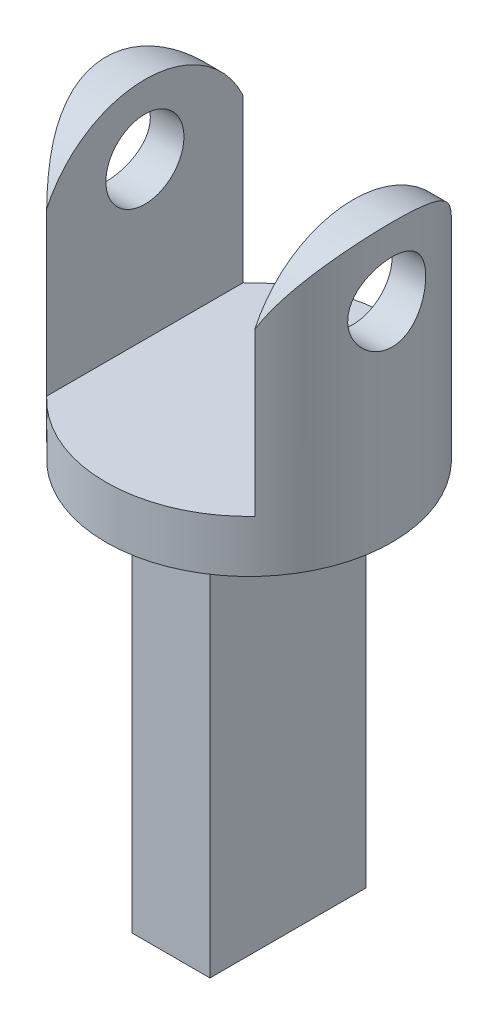
ISO-10303-21;
HEADER;
FILE_DESCRIPTION(('STEP AP214'),'2;1');
FILE_NAME('part.step','',(''),(''),'','','');
FILE_SCHEMA(('AUTOMOTIVE_DESIGN { 1 0 10303 214 1 1 1 1 }'));
ENDSEC;
DATA;
#1=APPLICATION_CONTEXT('core data for automotive mechanical design processes');
#2=APPLICATION_PROTOCOL_DEFINITION('international standard','automotive_design',2000,#1);
#3=PRODUCT_CONTEXT('',#1,'mechanical');
#4=PRODUCT('Part','Part','',(#3));
#5=PRODUCT_RELATED_PRODUCT_CATEGORY('part','',(#4));
#6=PRODUCT_DEFINITION_FORMATION('','',#4);
#7=PRODUCT_DEFINITION_CONTEXT('part definition',#1,'design');
#8=PRODUCT_DEFINITION('design','',#6,#7);
#9=PRODUCT_DEFINITION_SHAPE('','',#8);
#10=(LENGTH_UNIT() NAMED_UNIT(*) SI_UNIT(.MILLI.,.METRE.));
#11=(NAMED_UNIT(*) PLANE_ANGLE_UNIT() SI_UNIT($,.RADIAN.));
#12=(NAMED_UNIT(*) SI_UNIT($,.STERADIAN.) SOLID_ANGLE_UNIT());
#13=UNCERTAINTY_MEASURE_WITH_UNIT(LENGTH_MEASURE(1.E-05),#10,'distance_accuracy_value','');
#14=(GEOMETRIC_REPRESENTATION_CONTEXT(3) GLOBAL_UNCERTAINTY_ASSIGNED_CONTEXT((#13)) GLOBAL_UNIT_ASSIGNED_CONTEXT((#10,
#11,#12)) REPRESENTATION_CONTEXT('',''));
#15=CARTESIAN_POINT('',(0.,0.,0.));
#16=DIRECTION('',(0.,0.,1.));
#17=DIRECTION('',(1.,0.,0.));
#18=AXIS2_PLACEMENT_3D('',#15,#16,#17);
#19=CARTESIAN_POINT('',(4.,35.,-25.));
#20=DIRECTION('',(1.,0.,0.));
#21=DIRECTION('',(0.,1.,0.));
#22=AXIS2_PLACEMENT_3D('',#19,#20,#21);
#23=PLANE('',#22);
#24=CARTESIAN_POINT('',(4.,23.,0.));
#25=DIRECTION('',(1.,0.,0.));
#26=DIRECTION('',(0.,1.,0.));
#27=AXIS2_PLACEMENT_3D('',#24,#25,#26);
#28=CIRCLE('',#27,1.5);
#29=CARTESIAN_POINT('',(4.,24.5,0.));
#30=VERTEX_POINT('',#29);
#31=EDGE_CURVE('E170',#30,#30,#28,.T.);
#32=ORIENTED_EDGE('',*,*,#31,.T.);
#33=EDGE_LOOP('',(#32));
#34=FACE_BOUND('',#33,.T.);
#35=DIRECTION('',(0.,-1.,0.));
#36=VECTOR('',#35,1.);
#37=CARTESIAN_POINT('',(4.,26.,3.77491721763537));
#38=LINE('',#37,#36);
#39=CARTESIAN_POINT('',(4.,23.2320508075689,3.77491721763537));
#40=VERTEX_POINT('',#39);
#41=CARTESIAN_POINT('',(4.,17.,3.77491721763537));
#42=VERTEX_POINT('',#41);
#43=EDGE_CURVE('E199',#40,#42,#38,.T.);
#44=ORIENTED_EDGE('',*,*,#43,.F.);
#45=CARTESIAN_POINT('',(4.,21.5,0.));
#46=DIRECTION('',(1.,0.,0.));
#47=DIRECTION('',(0.,1.,0.));
#48=AXIS2_PLACEMENT_3D('',#45,#46,#47);
#49=CIRCLE('',#48,4.15331193145904);
#50=CARTESIAN_POINT('',(4.,23.2320508075689,-3.77491721763537));
#51=VERTEX_POINT('',#50);
#52=EDGE_CURVE('E151',#40,#51,#49,.F.);
#53=ORIENTED_EDGE('',*,*,#52,.T.);
#54=DIRECTION('',(0.,-1.,0.));
#55=VECTOR('',#54,1.);
#56=CARTESIAN_POINT('',(4.,26.,-3.77491721763537));
#57=LINE('',#56,#55);
#58=CARTESIAN_POINT('',(4.,17.,-3.77491721763537));
#59=VERTEX_POINT('',#58);
#60=EDGE_CURVE('E196',#59,#51,#57,.F.);
#61=ORIENTED_EDGE('',*,*,#60,.F.);
#62=DIRECTION('',(0.,0.,1.));
#63=VECTOR('',#62,1.);
#64=CARTESIAN_POINT('',(4.,17.,-25.));
#65=LINE('',#64,#63);
#66=EDGE_CURVE('E186',#59,#42,#65,.T.);
#67=ORIENTED_EDGE('',*,*,#66,.T.);
#68=EDGE_LOOP('',(#44,#53,#61,#67));
#69=FACE_BOUND('',#68,.T.);
#70=ADVANCED_FACE('F35',(#34,#69),#23,.F.);
#71=CARTESIAN_POINT('',(-4.,35.,-25.));
#72=DIRECTION('',(-1.,0.,0.));
#73=DIRECTION('',(0.,-1.,0.));
#74=AXIS2_PLACEMENT_3D('',#71,#72,#73);
#75=PLANE('',#74);
#76=CARTESIAN_POINT('',(-4.,23.,0.));
#77=DIRECTION('',(-1.,0.,0.));
#78=DIRECTION('',(0.,-1.,0.));
#79=AXIS2_PLACEMENT_3D('',#76,#77,#78);
#80=CIRCLE('',#79,1.5);
#81=CARTESIAN_POINT('',(-4.,21.5,0.));
#82=VERTEX_POINT('',#81);
#83=EDGE_CURVE('E169',#82,#82,#80,.T.);
#84=ORIENTED_EDGE('',*,*,#83,.T.);
#85=EDGE_LOOP('',(#84));
#86=FACE_BOUND('',#85,.T.);
#87=DIRECTION('',(0.,-1.,0.));
#88=VECTOR('',#87,1.);
#89=CARTESIAN_POINT('',(-4.,26.,-3.77491721763537));
#90=LINE('',#89,#88);
#91=CARTESIAN_POINT('',(-4.,23.2320508075689,-3.77491721763537));
#92=VERTEX_POINT('',#91);
#93=CARTESIAN_POINT('',(-4.,17.,-3.77491721763537));
#94=VERTEX_POINT('',#93);
#95=EDGE_CURVE('E194',#92,#94,#90,.T.);
#96=ORIENTED_EDGE('',*,*,#95,.F.);
#97=CARTESIAN_POINT('',(-4.,21.5,0.));
#98=DIRECTION('',(-1.,0.,0.));
#99=DIRECTION('',(0.,-1.,0.));
#100=AXIS2_PLACEMENT_3D('',#97,#98,#99);
#101=CIRCLE('',#100,4.15331193145904);
#102=CARTESIAN_POINT('',(-4.,23.2320508075689,3.77491721763537));
#103=VERTEX_POINT('',#102);
#104=EDGE_CURVE('E11',#92,#103,#101,.F.);
#105=ORIENTED_EDGE('',*,*,#104,.T.);
#106=DIRECTION('',(0.,-1.,0.));
#107=VECTOR('',#106,1.);
#108=CARTESIAN_POINT('',(-4.,26.,3.77491721763537));
#109=LINE('',#108,#107);
#110=CARTESIAN_POINT('',(-4.,17.,3.77491721763537));
#111=VERTEX_POINT('',#110);
#112=EDGE_CURVE('E189',#111,#103,#109,.F.);
#113=ORIENTED_EDGE('',*,*,#112,.F.);
#114=DIRECTION('',(0.,0.,1.));
#115=VECTOR('',#114,1.);
#116=CARTESIAN_POINT('',(-4.,17.,-25.));
#117=LINE('',#116,#115);
#118=EDGE_CURVE('E185',#94,#111,#117,.T.);
#119=ORIENTED_EDGE('',*,*,#118,.F.);
#120=EDGE_LOOP('',(#96,#105,#113,#119));
#121=FACE_BOUND('',#120,.T.);
#122=ADVANCED_FACE('F207',(#86,#121),#75,.F.);
#123=CARTESIAN_POINT('',(0.,26.,0.));
#124=DIRECTION('',(0.,-1.,0.));
#125=DIRECTION('',(0.,0.,-1.));
#126=AXIS2_PLACEMENT_3D('',#123,#124,#125);
#127=CYLINDRICAL_SURFACE('',#126,5.5);
#128=CARTESIAN_POINT('',(0.,15.,0.));
#129=DIRECTION('',(0.,1.,0.));
#130=DIRECTION('',(0.,0.,1.));
#131=AXIS2_PLACEMENT_3D('',#128,#129,#130);
#132=CIRCLE('',#131,5.5);
#133=CARTESIAN_POINT('',(0.,15.,5.5));
#134=VERTEX_POINT('',#133);
#135=EDGE_CURVE('E40',#134,#134,#132,.T.);
#136=ORIENTED_EDGE('',*,*,#135,.T.);
#137=EDGE_LOOP('',(#136));
#138=FACE_BOUND('',#137,.T.);
#139=CARTESIAN_POINT('',(-5.29150262212918,23.,-1.5));
#140=CARTESIAN_POINT('',(-5.29150397933242,23.0825564510277,-1.4999981569703));
#141=CARTESIAN_POINT('',(-5.29345578048323,23.1651321099555,-1.49316121586719));
#142=CARTESIAN_POINT('',(-5.3010274190552,23.3278935253,-1.46604910592423));
#143=CARTESIAN_POINT('',(-5.30664898703923,23.4080781354985,-1.44576759691971));
#144=CARTESIAN_POINT('',(-5.32087717395131,23.5636791879618,-1.39248674622751));
#145=CARTESIAN_POINT('',(-5.32947946238205,23.6391023609042,-1.35950584697685));
#146=CARTESIAN_POINT('',(-5.34869425130277,23.7833581342367,-1.2818207402325));
#147=CARTESIAN_POINT('',(-5.35930693404948,23.8521901362373,-1.23711546969878));
#148=CARTESIAN_POINT('',(-5.38165786345274,23.9831102067913,-1.13599985857016));
#149=CARTESIAN_POINT('',(-5.39341679089298,24.045000328378,-1.07933774218464));
#150=CARTESIAN_POINT('',(-5.41655710292429,24.1585276577255,-0.956458027204654));
#151=CARTESIAN_POINT('',(-5.4279384467319,24.210163760916,-0.890239400501257));
#152=CARTESIAN_POINT('',(-5.44927272086847,24.3025486268105,-0.748747592415014));
#153=CARTESIAN_POINT('',(-5.45919841481043,24.3430997218264,-0.6733408831181));
#154=CARTESIAN_POINT('',(-5.4762652255866,24.4108728681829,-0.516463712056492));
#155=CARTESIAN_POINT('',(-5.48340683437022,24.4380972745742,-0.434994324603003));
#156=CARTESIAN_POINT('',(-5.49395456075485,24.4778010982805,-0.270371451848024));
#157=CARTESIAN_POINT('',(-5.4974458959785,24.4906174442147,-0.187304783419292));
#158=CARTESIAN_POINT('',(-5.50059802264474,24.5022023022979,-0.0201318714747489));
#159=CARTESIAN_POINT('',(-5.50025948354,24.5009732695445,0.0639741877907296));
#160=CARTESIAN_POINT('',(-5.49585206403333,24.4847376013516,0.228490060702586));
#161=CARTESIAN_POINT('',(-5.49188178563756,24.4700951266807,0.308938859429587));
#162=CARTESIAN_POINT('',(-5.48077394096948,24.4280376676544,0.466191004896713));
#163=CARTESIAN_POINT('',(-5.47363619004791,24.4006219386716,0.542994138822176));
#164=CARTESIAN_POINT('',(-5.45685088879515,24.333522864157,0.691693236894896));
#165=CARTESIAN_POINT('',(-5.44717834180867,24.2937165513123,0.763530775491583));
#166=CARTESIAN_POINT('',(-5.4263628785745,24.2030611057326,0.899629268661));
#167=CARTESIAN_POINT('',(-5.41521966459727,24.1522097356286,0.963888684077535));
#168=CARTESIAN_POINT('',(-5.39224620796906,24.0389820048791,1.08518074875882));
#169=CARTESIAN_POINT('',(-5.38040539296798,23.9762883280592,1.14191553261874));
#170=CARTESIAN_POINT('',(-5.35769198772825,23.8421547848866,1.24414076282169));
#171=CARTESIAN_POINT('',(-5.34681946230361,23.7707143338136,1.28963045681796));
#172=CARTESIAN_POINT('',(-5.32722971617593,23.6204456059996,1.36831504906637));
#173=CARTESIAN_POINT('',(-5.31852743967169,23.5415709942258,1.40142544272702));
#174=CARTESIAN_POINT('',(-5.30444735453973,23.3790773977709,1.45381649809065));
#175=CARTESIAN_POINT('',(-5.29906867769277,23.2954596583672,1.47310077178258));
#176=CARTESIAN_POINT('',(-5.29243075183376,23.12864781849,1.49677126460125));
#177=CARTESIAN_POINT('',(-5.29104827888985,23.0455218132359,1.50160329063472));
#178=CARTESIAN_POINT('',(-5.29222151202243,22.8796488564579,1.49746332611022));
#179=CARTESIAN_POINT('',(-5.29477677694071,22.7969018635137,1.48849288189024));
#180=CARTESIAN_POINT('',(-5.30341820279288,22.6358775626886,1.45739637961775));
#181=CARTESIAN_POINT('',(-5.3094315020934,22.5575435793702,1.43554156609381));
#182=CARTESIAN_POINT('',(-5.32423951436502,22.4056539900694,1.37960331838531));
#183=CARTESIAN_POINT('',(-5.33303460273288,22.3320990306223,1.34551823366713));
#184=CARTESIAN_POINT('',(-5.3526656797527,22.189999291833,1.26519240779034));
#185=CARTESIAN_POINT('',(-5.36354371589181,22.121607425495,1.21869167395158));
#186=CARTESIAN_POINT('',(-5.3860176273416,21.9934339346148,1.11517441622706));
#187=CARTESIAN_POINT('',(-5.39761364372337,21.9336540098999,1.05815582137422));
#188=CARTESIAN_POINT('',(-5.42064365021152,21.8225336360494,0.933153363001187));
#189=CARTESIAN_POINT('',(-5.43206199790196,21.7715049965658,0.8648888475196));
#190=CARTESIAN_POINT('',(-5.45308956662174,21.681629364909,0.720505557506886));
#191=CARTESIAN_POINT('',(-5.46269888388575,21.6427817246722,0.644387201108797));
#192=CARTESIAN_POINT('',(-5.47896373225224,21.5787329337421,0.48699233815191));
#193=CARTESIAN_POINT('',(-5.48564141597945,21.5534291096995,0.405760013245424));
#194=CARTESIAN_POINT('',(-5.49538823820121,21.5168930474549,0.239985864722818));
#195=CARTESIAN_POINT('',(-5.4984582160406,21.5056575361731,0.155444815623817));
#196=CARTESIAN_POINT('',(-5.50060207356917,21.4977898799094,-0.0116397196820234));
#197=CARTESIAN_POINT('',(-5.49980084994582,21.5007013286933,-0.0941604093051925));
#198=CARTESIAN_POINT('',(-5.4945768528746,21.51997977731,-0.257491304637166));
#199=CARTESIAN_POINT('',(-5.49015422670854,21.5363462299303,-0.338301579771118));
#200=CARTESIAN_POINT('',(-5.47821112917835,21.5818073703395,-0.49534203369685));
#201=CARTESIAN_POINT('',(-5.47071413494114,21.6108056982402,-0.571602011794993));
#202=CARTESIAN_POINT('',(-5.45340440920124,21.6806216215351,-0.718217369622537));
#203=CARTESIAN_POINT('',(-5.44359134174256,21.7214409318066,-0.788571890732096));
#204=CARTESIAN_POINT('',(-5.42235787347661,21.8150547282817,-0.923488675195432));
#205=CARTESIAN_POINT('',(-5.41090053751388,21.8681490724366,-0.987837043212875));
#206=CARTESIAN_POINT('',(-5.38781343748961,21.9842421385502,-1.10686496193089));
#207=CARTESIAN_POINT('',(-5.37618362817694,22.0472435029512,-1.16154192474211));
#208=CARTESIAN_POINT('',(-5.35375507792812,22.1831275268309,-1.2609396606189));
#209=CARTESIAN_POINT('',(-5.34298201162846,22.2562062026808,-1.30539879787935));
#210=CARTESIAN_POINT('',(-5.32385655741428,22.4090859451496,-1.3813380630303));
#211=CARTESIAN_POINT('',(-5.31550265682104,22.4888827705103,-1.41282630671052));
#212=CARTESIAN_POINT('',(-5.30326481572331,22.6402680192525,-1.45802611152119));
#213=CARTESIAN_POINT('',(-5.29889066810921,22.7112284687515,-1.47372831222932));
#214=CARTESIAN_POINT('',(-5.29300915582115,22.8547877979027,-1.494715407894));
#215=CARTESIAN_POINT('',(-5.29150142838456,22.9273864690513,-1.5000016210592));
#216=CARTESIAN_POINT('',(-5.29150262212918,23.,-1.5));
#217=B_SPLINE_CURVE_WITH_KNOTS('',3,(#139,#140,#141,#142,#143,#144,#145,#146,#147,#148,#149,
#150,#151,#152,#153,#154,#155,#156,#157,#158,#159,#160,#161,#162,#163,#164,#165,#166,#167,#168,
#169,#170,#171,#172,#173,#174,#175,#176,#177,#178,#179,#180,#181,#182,#183,#184,#185,#186,#187,
#188,#189,#190,#191,#192,#193,#194,#195,#196,#197,#198,#199,#200,#201,#202,#203,#204,#205,#206,
#207,#208,#209,#210,#211,#212,#213,#214,#215,#216),.UNSPECIFIED.,.T.,.F.,(4,2,2,2,2,2,2,2,2,2,2,
2,2,2,2,2,2,2,2,2,2,2,2,2,2,2,2,2,2,2,2,2,2,2,2,2,2,2,4),(0.,0.247402201391972,
0.494921155336744,0.742082002291412,0.989265266888855,1.24229327000826,1.49534851471804,
1.75265882819586,2.00992365416647,2.26103843021061,2.51210931268385,2.75655962385664,
3.0010241872433,3.24799669713118,3.49501928234234,3.74996416866223,4.00492610732058,
4.26159801830626,4.51820285087414,4.76680611540842,5.01538153009582,5.25890187447338,
5.50245509545499,5.75157425489229,6.00074251835821,6.25748556676549,6.51421495339718,
6.76896951768223,7.02366480072505,7.27019876040455,7.51672269408902,7.7613981255949,
8.00610907011738,8.25758505394756,8.50912822664455,8.76653181226182,9.02377409687475,
9.24140725781328,9.45901287413894),.UNSPECIFIED.);
#218=CARTESIAN_POINT('',(-5.29150262212918,23.,-1.5));
#219=VERTEX_POINT('',#218);
#220=EDGE_CURVE('E179',#219,#219,#217,.T.);
#221=ORIENTED_EDGE('',*,*,#220,.T.);
#222=EDGE_LOOP('',(#221));
#223=FACE_BOUND('',#222,.T.);
#224=CARTESIAN_POINT('',(5.29150262212918,23.,-1.5));
#225=CARTESIAN_POINT('',(5.29150397933242,22.9174435489722,-1.4999981569703));
#226=CARTESIAN_POINT('',(5.29345578048323,22.8348678900445,-1.49316121586719));
#227=CARTESIAN_POINT('',(5.3010274190552,22.6721064747,-1.46604910592423));
#228=CARTESIAN_POINT('',(5.30664898703923,22.5919218645014,-1.44576759691971));
#229=CARTESIAN_POINT('',(5.32087717395131,22.4363208120381,-1.39248674622751));
#230=CARTESIAN_POINT('',(5.32947946238205,22.3608976390958,-1.35950584697685));
#231=CARTESIAN_POINT('',(5.34869425130277,22.2166418657633,-1.2818207402325));
#232=CARTESIAN_POINT('',(5.35930693404948,22.1478098637627,-1.23711546969878));
#233=CARTESIAN_POINT('',(5.38165786345274,22.0168897932086,-1.13599985857016));
#234=CARTESIAN_POINT('',(5.39341679089298,21.9549996716219,-1.07933774218464));
#235=CARTESIAN_POINT('',(5.41655710292429,21.8414723422745,-0.956458027204653));
#236=CARTESIAN_POINT('',(5.4279384467319,21.789836239084,-0.890239400501256));
#237=CARTESIAN_POINT('',(5.44927272086847,21.6974513731895,-0.748747592415014));
#238=CARTESIAN_POINT('',(5.45919841481043,21.6569002781735,-0.673340883118099));
#239=CARTESIAN_POINT('',(5.4762652255866,21.5891271318171,-0.516463712056491));
#240=CARTESIAN_POINT('',(5.48340683437022,21.5619027254258,-0.434994324603003));
#241=CARTESIAN_POINT('',(5.49395456075485,21.5221989017194,-0.270371451848024));
#242=CARTESIAN_POINT('',(5.4974458959785,21.5093825557852,-0.187304783419292));
#243=CARTESIAN_POINT('',(5.50059802264474,21.497797697702,-0.0201318714747491));
#244=CARTESIAN_POINT('',(5.50025948354,21.4990267304555,0.0639741877907296));
#245=CARTESIAN_POINT('',(5.49585206403333,21.5152623986484,0.228490060702586));
#246=CARTESIAN_POINT('',(5.49188178563756,21.5299048733192,0.308938859429587));
#247=CARTESIAN_POINT('',(5.48077394096948,21.5719623323456,0.466191004896713));
#248=CARTESIAN_POINT('',(5.47363619004791,21.5993780613283,0.542994138822176));
#249=CARTESIAN_POINT('',(5.45685088879515,21.666477135843,0.691693236894896));
#250=CARTESIAN_POINT('',(5.44717834180867,21.7062834486877,0.763530775491583));
#251=CARTESIAN_POINT('',(5.4263628785745,21.7969388942674,0.899629268661));
#252=CARTESIAN_POINT('',(5.41521966459727,21.8477902643713,0.963888684077535));
#253=CARTESIAN_POINT('',(5.39224620796906,21.9610179951208,1.08518074875882));
#254=CARTESIAN_POINT('',(5.38040539296798,22.0237116719408,1.14191553261874));
#255=CARTESIAN_POINT('',(5.35769198772825,22.1578452151133,1.24414076282169));
#256=CARTESIAN_POINT('',(5.34681946230361,22.2292856661864,1.28963045681796));
#257=CARTESIAN_POINT('',(5.32722971617593,22.3795543940003,1.36831504906637));
#258=CARTESIAN_POINT('',(5.31852743967169,22.4584290057742,1.40142544272702));
#259=CARTESIAN_POINT('',(5.30444735453973,22.6209226022291,1.45381649809065));
#260=CARTESIAN_POINT('',(5.29906867769277,22.7045403416328,1.47310077178258));
#261=CARTESIAN_POINT('',(5.29243075183376,22.87135218151,1.49677126460125));
#262=CARTESIAN_POINT('',(5.29104827888985,22.9544781867641,1.50160329063472));
#263=CARTESIAN_POINT('',(5.29222151202243,23.120351143542,1.49746332611022));
#264=CARTESIAN_POINT('',(5.29477677694071,23.2030981364863,1.48849288189024));
#265=CARTESIAN_POINT('',(5.30341820279288,23.3641224373113,1.45739637961775));
#266=CARTESIAN_POINT('',(5.3094315020934,23.4424564206298,1.43554156609381));
#267=CARTESIAN_POINT('',(5.32423951436502,23.5943460099306,1.37960331838531));
#268=CARTESIAN_POINT('',(5.33303460273288,23.6679009693777,1.34551823366713));
#269=CARTESIAN_POINT('',(5.3526656797527,23.810000708167,1.26519240779034));
#270=CARTESIAN_POINT('',(5.36354371589181,23.878392574505,1.21869167395158));
#271=CARTESIAN_POINT('',(5.3860176273416,24.0065660653851,1.11517441622706));
#272=CARTESIAN_POINT('',(5.39761364372337,24.0663459901001,1.05815582137422));
#273=CARTESIAN_POINT('',(5.42064365021152,24.1774663639506,0.933153363001187));
#274=CARTESIAN_POINT('',(5.43206199790196,24.2284950034342,0.864888847519599));
#275=CARTESIAN_POINT('',(5.45308956662174,24.318370635091,0.720505557506885));
#276=CARTESIAN_POINT('',(5.46269888388575,24.3572182753278,0.644387201108796));
#277=CARTESIAN_POINT('',(5.47896373225224,24.4212670662579,0.48699233815191));
#278=CARTESIAN_POINT('',(5.48564141597945,24.4465708903005,0.405760013245424));
#279=CARTESIAN_POINT('',(5.49538823820121,24.4831069525451,0.239985864722818));
#280=CARTESIAN_POINT('',(5.4984582160406,24.4943424638269,0.155444815623817));
#281=CARTESIAN_POINT('',(5.50060207356917,24.5022101200906,-0.0116397196820234));
#282=CARTESIAN_POINT('',(5.49980084994582,24.4992986713067,-0.0941604093051925));
#283=CARTESIAN_POINT('',(5.4945768528746,24.48002022269,-0.257491304637166));
#284=CARTESIAN_POINT('',(5.49015422670854,24.4636537700697,-0.338301579771118));
#285=CARTESIAN_POINT('',(5.47821112917835,24.4181926296605,-0.49534203369685));
#286=CARTESIAN_POINT('',(5.47071413494114,24.3891943017597,-0.571602011794993));
#287=CARTESIAN_POINT('',(5.45340440920124,24.3193783784649,-0.718217369622537));
#288=CARTESIAN_POINT('',(5.44359134174256,24.2785590681934,-0.788571890732096));
#289=CARTESIAN_POINT('',(5.42235787347661,24.1849452717183,-0.923488675195432));
#290=CARTESIAN_POINT('',(5.41090053751388,24.1318509275633,-0.987837043212875));
#291=CARTESIAN_POINT('',(5.38781343748961,24.0157578614498,-1.10686496193089));
#292=CARTESIAN_POINT('',(5.37618362817694,23.9527564970487,-1.16154192474211));
#293=CARTESIAN_POINT('',(5.35375507792812,23.8168724731691,-1.2609396606189));
#294=CARTESIAN_POINT('',(5.34298201162846,23.7437937973192,-1.30539879787935));
#295=CARTESIAN_POINT('',(5.32385655741428,23.5909140548504,-1.3813380630303));
#296=CARTESIAN_POINT('',(5.31550265682104,23.5111172294897,-1.41282630671052));
#297=CARTESIAN_POINT('',(5.30326481572331,23.3597319807474,-1.45802611152119));
#298=CARTESIAN_POINT('',(5.29889066810921,23.2887715312485,-1.47372831222932));
#299=CARTESIAN_POINT('',(5.29300915582115,23.1452122020973,-1.494715407894));
#300=CARTESIAN_POINT('',(5.29150142838456,23.0726135309487,-1.5000016210592));
#301=CARTESIAN_POINT('',(5.29150262212918,23.,-1.5));
#302=B_SPLINE_CURVE_WITH_KNOTS('',3,(#224,#225,#226,#227,#228,#229,#230,#231,#232,#233,#234,
#235,#236,#237,#238,#239,#240,#241,#242,#243,#244,#245,#246,#247,#248,#249,#250,#251,#252,#253,
#254,#255,#256,#257,#258,#259,#260,#261,#262,#263,#264,#265,#266,#267,#268,#269,#270,#271,#272,
#273,#274,#275,#276,#277,#278,#279,#280,#281,#282,#283,#284,#285,#286,#287,#288,#289,#290,#291,
#292,#293,#294,#295,#296,#297,#298,#299,#300,#301),.UNSPECIFIED.,.T.,.F.,(4,2,2,2,2,2,2,2,2,2,2,
2,2,2,2,2,2,2,2,2,2,2,2,2,2,2,2,2,2,2,2,2,2,2,2,2,2,2,4),(0.,0.247402201391972,
0.494921155336744,0.742082002291415,0.989265266888855,1.24229327000826,1.49534851471804,
1.75265882819586,2.00992365416647,2.26103843021061,2.51210931268385,2.75655962385664,
3.0010241872433,3.24799669713118,3.49501928234234,3.74996416866223,4.00492610732058,
4.26159801830626,4.51820285087414,4.76680611540842,5.01538153009582,5.25890187447338,
5.50245509545499,5.75157425489229,6.00074251835821,6.25748556676549,6.51421495339718,
6.76896951768224,7.02366480072506,7.27019876040455,7.51672269408903,7.7613981255949,
8.00610907011738,8.25758505394756,8.50912822664455,8.76653181226183,9.02377409687476,
9.24140725781328,9.45901287413894),.UNSPECIFIED.);
#303=CARTESIAN_POINT('',(5.29150262212918,23.,-1.5));
#304=VERTEX_POINT('',#303);
#305=EDGE_CURVE('E173',#304,#304,#302,.T.);
#306=ORIENTED_EDGE('',*,*,#305,.T.);
#307=EDGE_LOOP('',(#306));
#308=FACE_BOUND('',#307,.T.);
#309=ORIENTED_EDGE('',*,*,#112,.T.);
#310=CARTESIAN_POINT('',(-3.60555127546399,21.5,4.15331193145904));
#311=CARTESIAN_POINT('',(-3.60547040250049,21.5976537652712,4.15334445103078));
#312=CARTESIAN_POINT('',(-3.60951656871601,21.6952526292036,4.14986954341714));
#313=CARTESIAN_POINT('',(-3.6252271787589,21.8891426539515,4.13617188406569));
#314=CARTESIAN_POINT('',(-3.63687432100341,21.9854362788915,4.12596445654146));
#315=CARTESIAN_POINT('',(-3.66694769951464,22.1746569621928,4.09925193730759));
#316=CARTESIAN_POINT('',(-3.68527830376266,22.2676121272456,4.08283556980207));
#317=CARTESIAN_POINT('',(-3.72778055764887,22.4509458957926,4.04406779635878));
#318=CARTESIAN_POINT('',(-3.75195577934866,22.54132288567,4.02171276004906));
#319=CARTESIAN_POINT('',(-3.81072273658934,22.7378064480999,3.96614990671222));
#320=CARTESIAN_POINT('',(-3.84643602736842,22.8432107771946,3.9316475794461));
#321=CARTESIAN_POINT('',(-3.9231300880453,23.0492203124615,3.85512597544404));
#322=CARTESIAN_POINT('',(-3.964111901597,23.1498245623462,3.81310520871511));
#323=CARTESIAN_POINT('',(-4.09299844356465,23.4453281854628,3.67601125613255));
#324=CARTESIAN_POINT('',(-4.18650794315925,23.6328944510109,3.57020438033287));
#325=CARTESIAN_POINT('',(-4.38006375488353,23.9916226206615,3.33007554588051));
#326=CARTESIAN_POINT('',(-4.48020635517096,24.1623549541508,3.19519909229987));
#327=CARTESIAN_POINT('',(-4.67694467230511,24.4815280381837,2.89960074407404));
#328=CARTESIAN_POINT('',(-4.77354658693113,24.6300092991662,2.73892694918007));
#329=CARTESIAN_POINT('',(-4.95257244117467,24.8966599393664,2.39942686972138));
#330=CARTESIAN_POINT('',(-5.03541618112195,25.0158250947115,2.22161940523791));
#331=CARTESIAN_POINT('',(-5.14786880233851,25.1744965925157,1.93901504320507));
#332=CARTESIAN_POINT('',(-5.18340147065904,25.2240641228168,1.84210348348945));
#333=CARTESIAN_POINT('',(-5.24978738322213,25.3159245811212,1.64337644867618));
#334=CARTESIAN_POINT('',(-5.28064290210647,25.3582210466179,1.5415633892782));
#335=CARTESIAN_POINT('',(-5.33723823615638,25.4353275615042,1.33256278162993));
#336=CARTESIAN_POINT('',(-5.36292579890519,25.470061410006,1.22533284316755));
#337=CARTESIAN_POINT('',(-5.4081290822959,25.5309149837235,1.00723893743802));
#338=CARTESIAN_POINT('',(-5.42764817913843,25.5570394214843,0.896376994885952));
#339=CARTESIAN_POINT('',(-5.45996620152354,25.6001749867533,0.672014890769008));
#340=CARTESIAN_POINT('',(-5.47277036003147,25.6171932109635,0.558516855769085));
#341=CARTESIAN_POINT('',(-5.49129147568882,25.641780813524,0.329935768269791));
#342=CARTESIAN_POINT('',(-5.4970097018813,25.649351883798,0.214853003318929));
#343=CARTESIAN_POINT('',(-5.50086818314378,25.6544616191678,0.00191325379482998));
#344=CARTESIAN_POINT('',(-5.50003042718692,25.6533532681761,-0.0958963109978608));
#345=CARTESIAN_POINT('',(-5.49316190230219,25.6442534707143,-0.291043486589168));
#346=CARTESIAN_POINT('',(-5.48712955395367,25.636259930796,-0.38838094479046));
#347=CARTESIAN_POINT('',(-5.47000506018238,25.6135157601249,-0.58177422543297));
#348=CARTESIAN_POINT('',(-5.45891487560159,25.5987677479632,-0.677830529717118));
#349=CARTESIAN_POINT('',(-5.43192050014674,25.5627452967543,-0.868036486986254));
#350=CARTESIAN_POINT('',(-5.41601443317236,25.5414683142036,-0.962185381633183));
#351=CARTESIAN_POINT('',(-5.36264175550506,25.4697541638921,-1.23516831895388));
#352=CARTESIAN_POINT('',(-5.31894494002206,25.410683514933,-1.41061482164376));
#353=CARTESIAN_POINT('',(-5.21763868152048,25.2717376146884,-1.74856317630322));
#354=CARTESIAN_POINT('',(-5.1600268513403,25.1918587935152,-1.91106280082991));
#355=CARTESIAN_POINT('',(-5.02595888686376,25.0021928159957,-2.24178892176472));
#356=CARTESIAN_POINT('',(-4.94801917612083,24.889849672731,-2.40794041317521));
#357=CARTESIAN_POINT('',(-4.78355620122666,24.6449463776872,-2.7200651203762));
#358=CARTESIAN_POINT('',(-4.69702292236105,24.5123625389856,-2.86601430756722));
#359=CARTESIAN_POINT('',(-4.55584894742765,24.2857078429398,-3.08280741429558));
#360=CARTESIAN_POINT('',(-4.50223781597343,24.1973388840586,-3.16040697016601));
#361=CARTESIAN_POINT('',(-4.39504549079252,24.0143451275046,-3.30785011847919));
#362=CARTESIAN_POINT('',(-4.34146429308014,23.9197217046599,-3.37769540644449));
#363=CARTESIAN_POINT('',(-4.23565932684829,23.7243120587831,-3.50946296315179));
#364=CARTESIAN_POINT('',(-4.18343615230125,23.6235232016367,-3.57138180997259));
#365=CARTESIAN_POINT('',(-4.08198176910243,23.4159239660317,-3.68691458686422));
#366=CARTESIAN_POINT('',(-4.03274938588635,23.3091159836314,-3.74053179019498));
#367=CARTESIAN_POINT('',(-3.91948216930946,23.0434574612212,-3.85965243764111));
#368=CARTESIAN_POINT('',(-3.85787041822836,22.8815269645307,-3.92074558683356));
#369=CARTESIAN_POINT('',(-3.75113787165504,22.5468488919203,-4.02299360084131));
#370=CARTESIAN_POINT('',(-3.70594534100126,22.3741523285229,-4.06423545870904));
#371=CARTESIAN_POINT('',(-3.65081081572278,22.0838279875265,-4.11368628795512));
#372=CARTESIAN_POINT('',(-3.63404142074593,21.9686134788316,-4.12843502540582));
#373=CARTESIAN_POINT('',(-3.61705550099533,21.7940723544053,-4.14330338521387));
#374=CARTESIAN_POINT('',(-3.6127543860935,21.7354258693232,-4.14705060823876));
#375=CARTESIAN_POINT('',(-3.60699694725637,21.6178577496237,-4.15205721680613));
#376=CARTESIAN_POINT('',(-3.60554209912899,21.5589359881359,-4.15331531172323));
#377=CARTESIAN_POINT('',(-3.60555127546399,21.5,-4.15331193145904));
#378=B_SPLINE_CURVE_WITH_KNOTS('',3,(#310,#311,#312,#313,#314,#315,#316,#317,#318,#319,#320,
#321,#322,#323,#324,#325,#326,#327,#328,#329,#330,#331,#332,#333,#334,#335,#336,#337,#338,#339,
#340,#341,#342,#343,#344,#345,#346,#347,#348,#349,#350,#351,#352,#353,#354,#355,#356,#357,#358,
#359,#360,#361,#362,#363,#364,#365,#366,#367,#368,#369,#370,#371,#372,#373,#374,#375,#376,#377),
.UNSPECIFIED.,.F.,.F.,(4,2,2,2,2,2,2,2,2,2,2,2,2,2,2,2,2,2,2,2,2,2,2,2,2,2,2,2,2,2,2,2,2,4),(0.,
0.292728216601007,0.584792429144946,0.872831813958145,1.1610476871561,1.51004508903029,
1.85911173144474,2.56055866198317,3.2768041674504,3.99172940200932,4.67724064531699,
5.0203972876737,5.36338650322484,5.70968631736051,6.05579626082551,6.40163607777832,
6.74741394817879,7.04050022963745,7.33367565573009,7.62673751890397,7.91991369600548,
8.48804405790041,9.05627195353878,9.69949918423067,10.3434850129496,10.7308932279985,
11.1182165661161,11.5057065555705,11.8930433701425,12.4424107538034,12.9893482520635,
13.3405267001499,13.517185075489,13.6939350250995),.UNSPECIFIED.);
#379=EDGE_CURVE('E143',#103,#92,#378,.T.);
#380=ORIENTED_EDGE('',*,*,#379,.T.);
#381=ORIENTED_EDGE('',*,*,#95,.T.);
#382=CARTESIAN_POINT('',(0.,17.,0.));
#383=DIRECTION('',(0.,-1.,0.));
#384=DIRECTION('',(0.,0.,-1.));
#385=AXIS2_PLACEMENT_3D('',#382,#383,#384);
#386=CIRCLE('',#385,5.5);
#387=EDGE_CURVE('E45',#94,#59,#386,.T.);
#388=ORIENTED_EDGE('',*,*,#387,.T.);
#389=ORIENTED_EDGE('',*,*,#60,.T.);
#390=CARTESIAN_POINT('',(3.60555127546399,21.5,-4.15331193145904));
#391=CARTESIAN_POINT('',(3.60547040250049,21.5976537652712,-4.15334445103078));
#392=CARTESIAN_POINT('',(3.60951656871601,21.6952526292036,-4.14986954341714));
#393=CARTESIAN_POINT('',(3.6252271787589,21.8891426539515,-4.13617188406569));
#394=CARTESIAN_POINT('',(3.63687432100341,21.9854362788915,-4.12596445654146));
#395=CARTESIAN_POINT('',(3.66694769951464,22.1746569621928,-4.09925193730759));
#396=CARTESIAN_POINT('',(3.68527830376266,22.2676121272456,-4.08283556980207));
#397=CARTESIAN_POINT('',(3.72778055764887,22.4509458957926,-4.04406779635878));
#398=CARTESIAN_POINT('',(3.75195577934866,22.54132288567,-4.02171276004906));
#399=CARTESIAN_POINT('',(3.81072273658934,22.7378064480999,-3.96614990671222));
#400=CARTESIAN_POINT('',(3.84643602736842,22.8432107771946,-3.9316475794461));
#401=CARTESIAN_POINT('',(3.9231300880453,23.0492203124615,-3.85512597544404));
#402=CARTESIAN_POINT('',(3.964111901597,23.1498245623462,-3.81310520871511));
#403=CARTESIAN_POINT('',(4.09299844356465,23.4453281854628,-3.67601125613255));
#404=CARTESIAN_POINT('',(4.18650794315925,23.6328944510109,-3.57020438033287));
#405=CARTESIAN_POINT('',(4.38006375488353,23.9916226206615,-3.33007554588051));
#406=CARTESIAN_POINT('',(4.48020635517096,24.1623549541508,-3.19519909229987));
#407=CARTESIAN_POINT('',(4.67694467230511,24.4815280381837,-2.89960074407404));
#408=CARTESIAN_POINT('',(4.77354658693113,24.6300092991662,-2.73892694918007));
#409=CARTESIAN_POINT('',(4.95257244117467,24.8966599393664,-2.39942686972138));
#410=CARTESIAN_POINT('',(5.03541618112195,25.0158250947115,-2.22161940523791));
#411=CARTESIAN_POINT('',(5.14786880233851,25.1744965925157,-1.93901504320507));
#412=CARTESIAN_POINT('',(5.18340147065904,25.2240641228168,-1.84210348348945));
#413=CARTESIAN_POINT('',(5.24978738322213,25.3159245811212,-1.64337644867618));
#414=CARTESIAN_POINT('',(5.28064290210647,25.3582210466179,-1.5415633892782));
#415=CARTESIAN_POINT('',(5.33723823615638,25.4353275615042,-1.33256278162993));
#416=CARTESIAN_POINT('',(5.36292579890519,25.470061410006,-1.22533284316755));
#417=CARTESIAN_POINT('',(5.4081290822959,25.5309149837235,-1.00723893743802));
#418=CARTESIAN_POINT('',(5.42764817913843,25.5570394214843,-0.896376994885952));
#419=CARTESIAN_POINT('',(5.45996620152354,25.6001749867533,-0.672014890769008));
#420=CARTESIAN_POINT('',(5.47277036003147,25.6171932109635,-0.558516855769085));
#421=CARTESIAN_POINT('',(5.49129147568882,25.641780813524,-0.329935768269791));
#422=CARTESIAN_POINT('',(5.4970097018813,25.649351883798,-0.214853003318929));
#423=CARTESIAN_POINT('',(5.50086818314378,25.6544616191678,-0.00191325379482998));
#424=CARTESIAN_POINT('',(5.50003042718692,25.6533532681761,0.0958963109978608));
#425=CARTESIAN_POINT('',(5.49316190230219,25.6442534707143,0.291043486589168));
#426=CARTESIAN_POINT('',(5.48712955395367,25.636259930796,0.38838094479046));
#427=CARTESIAN_POINT('',(5.47000506018238,25.6135157601249,0.58177422543297));
#428=CARTESIAN_POINT('',(5.45891487560159,25.5987677479632,0.677830529717118));
#429=CARTESIAN_POINT('',(5.43192050014674,25.5627452967543,0.868036486986254));
#430=CARTESIAN_POINT('',(5.41601443317236,25.5414683142036,0.962185381633183));
#431=CARTESIAN_POINT('',(5.36264175550506,25.4697541638921,1.23516831895388));
#432=CARTESIAN_POINT('',(5.31894494002206,25.410683514933,1.41061482164376));
#433=CARTESIAN_POINT('',(5.21763868152048,25.2717376146884,1.74856317630322));
#434=CARTESIAN_POINT('',(5.1600268513403,25.1918587935152,1.91106280082991));
#435=CARTESIAN_POINT('',(5.02595888686376,25.0021928159957,2.24178892176472));
#436=CARTESIAN_POINT('',(4.94801917612083,24.889849672731,2.40794041317521));
#437=CARTESIAN_POINT('',(4.78355620122666,24.6449463776872,2.7200651203762));
#438=CARTESIAN_POINT('',(4.69702292236105,24.5123625389856,2.86601430756722));
#439=CARTESIAN_POINT('',(4.55584894742765,24.2857078429398,3.08280741429558));
#440=CARTESIAN_POINT('',(4.50223781597343,24.1973388840586,3.16040697016601));
#441=CARTESIAN_POINT('',(4.39504549079252,24.0143451275046,3.30785011847919));
#442=CARTESIAN_POINT('',(4.34146429308014,23.9197217046599,3.37769540644449));
#443=CARTESIAN_POINT('',(4.23565932684829,23.7243120587831,3.50946296315179));
#444=CARTESIAN_POINT('',(4.18343615230125,23.6235232016367,3.57138180997259));
#445=CARTESIAN_POINT('',(4.08198176910243,23.4159239660317,3.68691458686422));
#446=CARTESIAN_POINT('',(4.03274938588635,23.3091159836314,3.74053179019498));
#447=CARTESIAN_POINT('',(3.91948216930946,23.0434574612212,3.85965243764111));
#448=CARTESIAN_POINT('',(3.85787041822836,22.8815269645307,3.92074558683356));
#449=CARTESIAN_POINT('',(3.75113787165504,22.5468488919203,4.02299360084131));
#450=CARTESIAN_POINT('',(3.70594534100126,22.3741523285229,4.06423545870904));
#451=CARTESIAN_POINT('',(3.65081081572278,22.0838279875265,4.11368628795512));
#452=CARTESIAN_POINT('',(3.63404142074593,21.9686134788316,4.12843502540582));
#453=CARTESIAN_POINT('',(3.61705550099533,21.7940723544053,4.14330338521387));
#454=CARTESIAN_POINT('',(3.6127543860935,21.7354258693232,4.14705060823876));
#455=CARTESIAN_POINT('',(3.60699694725637,21.6178577496237,4.15205721680613));
#456=CARTESIAN_POINT('',(3.60554209912899,21.5589359881359,4.15331531172323));
#457=CARTESIAN_POINT('',(3.60555127546399,21.5,4.15331193145904));
#458=B_SPLINE_CURVE_WITH_KNOTS('',3,(#390,#391,#392,#393,#394,#395,#396,#397,#398,#399,#400,
#401,#402,#403,#404,#405,#406,#407,#408,#409,#410,#411,#412,#413,#414,#415,#416,#417,#418,#419,
#420,#421,#422,#423,#424,#425,#426,#427,#428,#429,#430,#431,#432,#433,#434,#435,#436,#437,#438,
#439,#440,#441,#442,#443,#444,#445,#446,#447,#448,#449,#450,#451,#452,#453,#454,#455,#456,#457),
.UNSPECIFIED.,.F.,.F.,(4,2,2,2,2,2,2,2,2,2,2,2,2,2,2,2,2,2,2,2,2,2,2,2,2,2,2,2,2,2,2,2,2,4),(0.,
0.292728216601007,0.584792429144946,0.872831813958145,1.1610476871561,1.51004508903029,
1.85911173144474,2.56055866198317,3.2768041674504,3.99172940200932,4.67724064531699,
5.0203972876737,5.36338650322484,5.70968631736051,6.05579626082551,6.40163607777832,
6.74741394817879,7.04050022963745,7.33367565573009,7.62673751890397,7.91991369600548,
8.48804405790041,9.05627195353878,9.69949918423067,10.3434850129496,10.7308932279985,
11.1182165661161,11.5057065555705,11.8930433701425,12.4424107538034,12.9893482520635,
13.3405267001499,13.517185075489,13.6939350250995),.UNSPECIFIED.);
#459=EDGE_CURVE('E59',#51,#40,#458,.T.);
#460=ORIENTED_EDGE('',*,*,#459,.T.);
#461=ORIENTED_EDGE('',*,*,#43,.T.);
#462=EDGE_CURVE('E201',#42,#111,#386,.T.);
#463=ORIENTED_EDGE('',*,*,#462,.T.);
#464=EDGE_LOOP('',(#309,#380,#381,#388,#389,#460,#461,#463));
#465=FACE_BOUND('',#464,.T.);
#466=ADVANCED_FACE('F37',(#138,#223,#308,#465),#127,.T.);
#467=CARTESIAN_POINT('',(-4.,17.,-25.));
#468=DIRECTION('',(0.,-1.,0.));
#469=DIRECTION('',(0.,0.,-1.));
#470=AXIS2_PLACEMENT_3D('',#467,#468,#469);
#471=PLANE('',#470);
#472=ORIENTED_EDGE('',*,*,#66,.F.);
#473=ORIENTED_EDGE('',*,*,#387,.F.);
#474=ORIENTED_EDGE('',*,*,#118,.T.);
#475=ORIENTED_EDGE('',*,*,#462,.F.);
#476=EDGE_LOOP('',(#472,#473,#474,#475));
#477=FACE_BOUND('',#476,.T.);
#478=ADVANCED_FACE('F213',(#477),#471,.F.);
#479=CARTESIAN_POINT('',(-29.,23.,0.));
#480=DIRECTION('',(1.,0.,0.));
#481=DIRECTION('',(0.,0.,-1.));
#482=AXIS2_PLACEMENT_3D('',#479,#480,#481);
#483=CYLINDRICAL_SURFACE('',#482,1.5);
#484=ORIENTED_EDGE('',*,*,#83,.F.);
#485=EDGE_LOOP('',(#484));
#486=FACE_BOUND('',#485,.T.);
#487=ORIENTED_EDGE('',*,*,#220,.F.);
#488=EDGE_LOOP('',(#487));
#489=FACE_BOUND('',#488,.T.);
#490=ADVANCED_FACE('F160',(#486,#489),#483,.F.);
#491=ORIENTED_EDGE('',*,*,#31,.F.);
#492=EDGE_LOOP('',(#491));
#493=FACE_BOUND('',#492,.T.);
#494=ORIENTED_EDGE('',*,*,#305,.F.);
#495=EDGE_LOOP('',(#494));
#496=FACE_BOUND('',#495,.T.);
#497=ADVANCED_FACE('F212',(#493,#496),#483,.F.);
#498=CARTESIAN_POINT('',(-11.,21.5,0.));
#499=DIRECTION('',(1.,0.,0.));
#500=DIRECTION('',(0.,0.,-1.));
#501=AXIS2_PLACEMENT_3D('',#498,#499,#500);
#502=CYLINDRICAL_SURFACE('',#501,4.15331193145904);
#503=ORIENTED_EDGE('',*,*,#104,.F.);
#504=ORIENTED_EDGE('',*,*,#379,.F.);
#505=EDGE_LOOP('',(#503,#504));
#506=FACE_BOUND('',#505,.T.);
#507=ADVANCED_FACE('F158',(#506),#502,.T.);
#508=ORIENTED_EDGE('',*,*,#52,.F.);
#509=ORIENTED_EDGE('',*,*,#459,.F.);
#510=EDGE_LOOP('',(#508,#509));
#511=FACE_BOUND('',#510,.T.);
#512=ADVANCED_FACE('F153',(#511),#502,.T.);
#513=CARTESIAN_POINT('',(0.,15.,0.));
#514=DIRECTION('',(0.,1.,0.));
#515=DIRECTION('',(0.,0.,1.));
#516=AXIS2_PLACEMENT_3D('',#513,#514,#515);
#517=PLANE('',#516);
#518=DIRECTION('',(0.,0.,1.));
#519=VECTOR('',#518,1.);
#520=CARTESIAN_POINT('',(1.5,15.,-3.));
#521=LINE('',#520,#519);
#522=CARTESIAN_POINT('',(1.5,15.,-3.));
#523=VERTEX_POINT('',#522);
#524=CARTESIAN_POINT('',(1.5,15.,3.));
#525=VERTEX_POINT('',#524);
#526=EDGE_CURVE('E121',#523,#525,#521,.T.);
#527=ORIENTED_EDGE('',*,*,#526,.F.);
#528=DIRECTION('',(1.,0.,0.));
#529=VECTOR('',#528,1.);
#530=CARTESIAN_POINT('',(-1.5,15.,-3.));
#531=LINE('',#530,#529);
#532=CARTESIAN_POINT('',(-1.5,15.,-3.));
#533=VERTEX_POINT('',#532);
#534=EDGE_CURVE('E114',#533,#523,#531,.T.);
#535=ORIENTED_EDGE('',*,*,#534,.F.);
#536=DIRECTION('',(0.,0.,-1.));
#537=VECTOR('',#536,1.);
#538=CARTESIAN_POINT('',(-1.5,15.,-3.));
#539=LINE('',#538,#537);
#540=CARTESIAN_POINT('',(-1.5,15.,3.));
#541=VERTEX_POINT('',#540);
#542=EDGE_CURVE('E124',#541,#533,#539,.T.);
#543=ORIENTED_EDGE('',*,*,#542,.F.);
#544=DIRECTION('',(-1.,0.,0.));
#545=VECTOR('',#544,1.);
#546=CARTESIAN_POINT('',(-1.5,15.,3.));
#547=LINE('',#546,#545);
#548=EDGE_CURVE('E106',#525,#541,#547,.T.);
#549=ORIENTED_EDGE('',*,*,#548,.F.);
#550=EDGE_LOOP('',(#527,#535,#543,#549));
#551=FACE_BOUND('',#550,.T.);
#552=ORIENTED_EDGE('',*,*,#135,.F.);
#553=EDGE_LOOP('',(#552));
#554=FACE_BOUND('',#553,.T.);
#555=ADVANCED_FACE('F118',(#551,#554),#517,.F.);
#556=CARTESIAN_POINT('',(1.5,15.,-3.));
#557=DIRECTION('',(1.,0.,0.));
#558=DIRECTION('',(0.,0.,-1.));
#559=AXIS2_PLACEMENT_3D('',#556,#557,#558);
#560=PLANE('',#559);
#561=DIRECTION('',(0.,0.,1.));
#562=VECTOR('',#561,1.);
#563=CARTESIAN_POINT('',(1.5,0.,-3.));
#564=LINE('',#563,#562);
#565=CARTESIAN_POINT('',(1.5,0.,-3.));
#566=VERTEX_POINT('',#565);
#567=CARTESIAN_POINT('',(1.5,0.,3.));
#568=VERTEX_POINT('',#567);
#569=EDGE_CURVE('E135',#566,#568,#564,.T.);
#570=ORIENTED_EDGE('',*,*,#569,.F.);
#571=DIRECTION('',(0.,-1.,0.));
#572=VECTOR('',#571,1.);
#573=CARTESIAN_POINT('',(1.5,15.,-3.));
#574=LINE('',#573,#572);
#575=EDGE_CURVE('E127',#523,#566,#574,.T.);
#576=ORIENTED_EDGE('',*,*,#575,.F.);
#577=ORIENTED_EDGE('',*,*,#526,.T.);
#578=DIRECTION('',(0.,-1.,0.));
#579=VECTOR('',#578,1.);
#580=CARTESIAN_POINT('',(1.5,15.,3.));
#581=LINE('',#580,#579);
#582=EDGE_CURVE('E103',#525,#568,#581,.T.);
#583=ORIENTED_EDGE('',*,*,#582,.T.);
#584=EDGE_LOOP('',(#570,#576,#577,#583));
#585=FACE_BOUND('',#584,.T.);
#586=ADVANCED_FACE('F126',(#585),#560,.T.);
#587=CARTESIAN_POINT('',(-1.5,15.,-3.));
#588=DIRECTION('',(0.,0.,-1.));
#589=DIRECTION('',(-1.,0.,0.));
#590=AXIS2_PLACEMENT_3D('',#587,#588,#589);
#591=PLANE('',#590);
#592=DIRECTION('',(1.,0.,0.));
#593=VECTOR('',#592,1.);
#594=CARTESIAN_POINT('',(-1.5,0.,-3.));
#595=LINE('',#594,#593);
#596=CARTESIAN_POINT('',(-1.5,0.,-3.));
#597=VERTEX_POINT('',#596);
#598=EDGE_CURVE('E128',#597,#566,#595,.T.);
#599=ORIENTED_EDGE('',*,*,#598,.F.);
#600=DIRECTION('',(0.,-1.,0.));
#601=VECTOR('',#600,1.);
#602=CARTESIAN_POINT('',(-1.5,15.,-3.));
#603=LINE('',#602,#601);
#604=EDGE_CURVE('E140',#533,#597,#603,.T.);
#605=ORIENTED_EDGE('',*,*,#604,.F.);
#606=ORIENTED_EDGE('',*,*,#534,.T.);
#607=ORIENTED_EDGE('',*,*,#575,.T.);
#608=EDGE_LOOP('',(#599,#605,#606,#607));
#609=FACE_BOUND('',#608,.T.);
#610=ADVANCED_FACE('F247',(#609),#591,.T.);
#611=CARTESIAN_POINT('',(-1.5,15.,-3.));
#612=DIRECTION('',(-1.,0.,0.));
#613=DIRECTION('',(0.,0.,1.));
#614=AXIS2_PLACEMENT_3D('',#611,#612,#613);
#615=PLANE('',#614);
#616=DIRECTION('',(0.,0.,-1.));
#617=VECTOR('',#616,1.);
#618=CARTESIAN_POINT('',(-1.5,0.,-3.));
#619=LINE('',#618,#617);
#620=CARTESIAN_POINT('',(-1.5,0.,3.));
#621=VERTEX_POINT('',#620);
#622=EDGE_CURVE('E52',#621,#597,#619,.T.);
#623=ORIENTED_EDGE('',*,*,#622,.F.);
#624=DIRECTION('',(0.,-1.,0.));
#625=VECTOR('',#624,1.);
#626=CARTESIAN_POINT('',(-1.5,15.,3.));
#627=LINE('',#626,#625);
#628=EDGE_CURVE('E113',#541,#621,#627,.T.);
#629=ORIENTED_EDGE('',*,*,#628,.F.);
#630=ORIENTED_EDGE('',*,*,#542,.T.);
#631=ORIENTED_EDGE('',*,*,#604,.T.);
#632=EDGE_LOOP('',(#623,#629,#630,#631));
#633=FACE_BOUND('',#632,.T.);
#634=ADVANCED_FACE('F243',(#633),#615,.T.);
#635=CARTESIAN_POINT('',(-1.5,15.,3.));
#636=DIRECTION('',(0.,0.,1.));
#637=DIRECTION('',(1.,0.,0.));
#638=AXIS2_PLACEMENT_3D('',#635,#636,#637);
#639=PLANE('',#638);
#640=DIRECTION('',(-1.,0.,0.));
#641=VECTOR('',#640,1.);
#642=CARTESIAN_POINT('',(-1.5,0.,3.));
#643=LINE('',#642,#641);
#644=EDGE_CURVE('E108',#568,#621,#643,.T.);
#645=ORIENTED_EDGE('',*,*,#644,.F.);
#646=ORIENTED_EDGE('',*,*,#582,.F.);
#647=ORIENTED_EDGE('',*,*,#548,.T.);
#648=ORIENTED_EDGE('',*,*,#628,.T.);
#649=EDGE_LOOP('',(#645,#646,#647,#648));
#650=FACE_BOUND('',#649,.T.);
#651=ADVANCED_FACE('F105',(#650),#639,.T.);
#652=CARTESIAN_POINT('',(0.,0.,0.));
#653=DIRECTION('',(0.,1.,0.));
#654=DIRECTION('',(0.,0.,1.));
#655=AXIS2_PLACEMENT_3D('',#652,#653,#654);
#656=PLANE('',#655);
#657=ORIENTED_EDGE('',*,*,#569,.T.);
#658=ORIENTED_EDGE('',*,*,#644,.T.);
#659=ORIENTED_EDGE('',*,*,#622,.T.);
#660=ORIENTED_EDGE('',*,*,#598,.T.);
#661=EDGE_LOOP('',(#657,#658,#659,#660));
#662=FACE_BOUND('',#661,.T.);
#663=ADVANCED_FACE('F237',(#662),#656,.F.);
#664=CLOSED_SHELL('',(#70,#122,#466,#478,#490,#497,#507,#512,#555,#586,#610,#634,#651,#663));
#665=MANIFOLD_SOLID_BREP('B2',#664);
#666=ADVANCED_BREP_SHAPE_REPRESENTATION('',(#18,#665),#14);
#667=SHAPE_DEFINITION_REPRESENTATION(#9,#666);
ENDSEC;
END-ISO-10303-21;
